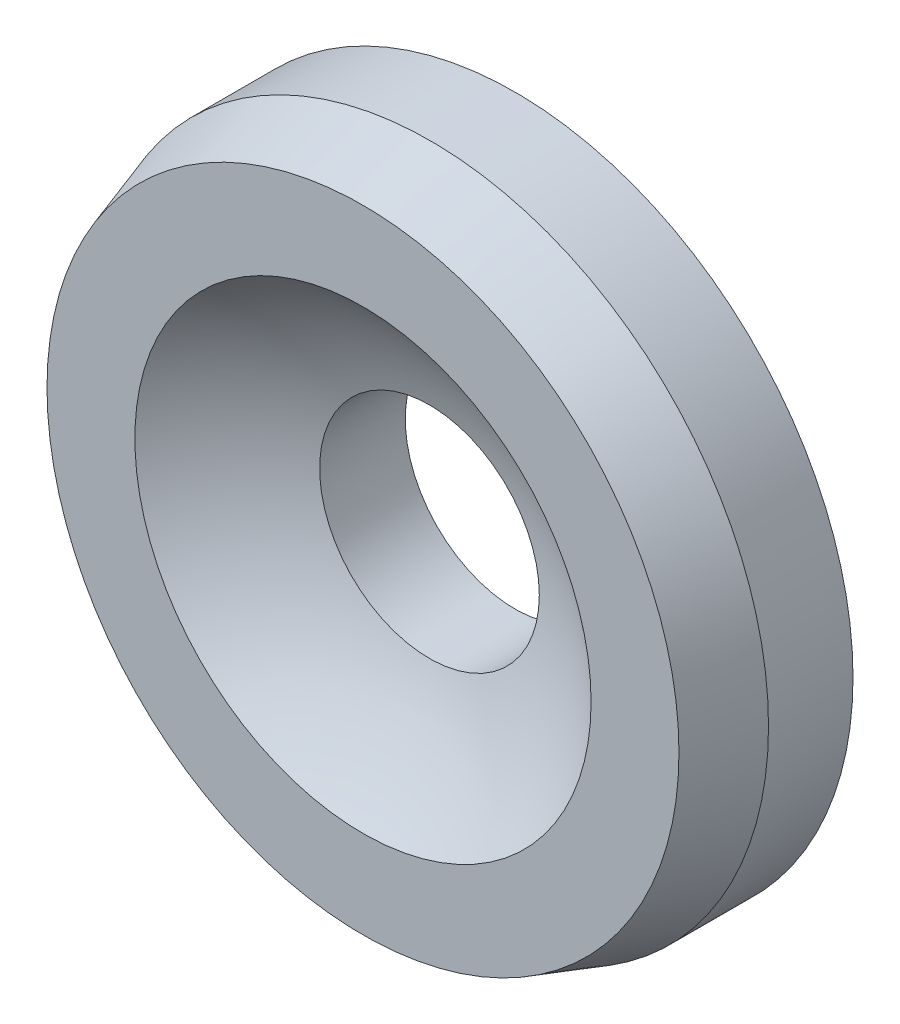
ISO-10303-21;
HEADER;
FILE_DESCRIPTION(('STEP AP214'),'2;1');
FILE_NAME('part.step','',(''),(''),'','','');
FILE_SCHEMA(('AUTOMOTIVE_DESIGN { 1 0 10303 214 1 1 1 1 }'));
ENDSEC;
DATA;
#1=APPLICATION_CONTEXT('core data for automotive mechanical design processes');
#2=APPLICATION_PROTOCOL_DEFINITION('international standard','automotive_design',2000,#1);
#3=PRODUCT_CONTEXT('',#1,'mechanical');
#4=PRODUCT('Part','Part','',(#3));
#5=PRODUCT_RELATED_PRODUCT_CATEGORY('part','',(#4));
#6=PRODUCT_DEFINITION_FORMATION('','',#4);
#7=PRODUCT_DEFINITION_CONTEXT('part definition',#1,'design');
#8=PRODUCT_DEFINITION('design','',#6,#7);
#9=PRODUCT_DEFINITION_SHAPE('','',#8);
#10=(LENGTH_UNIT() NAMED_UNIT(*) SI_UNIT(.MILLI.,.METRE.));
#11=(NAMED_UNIT(*) PLANE_ANGLE_UNIT() SI_UNIT($,.RADIAN.));
#12=(NAMED_UNIT(*) SI_UNIT($,.STERADIAN.) SOLID_ANGLE_UNIT());
#13=UNCERTAINTY_MEASURE_WITH_UNIT(LENGTH_MEASURE(1.E-05),#10,'distance_accuracy_value','');
#14=(GEOMETRIC_REPRESENTATION_CONTEXT(3) GLOBAL_UNCERTAINTY_ASSIGNED_CONTEXT((#13)) GLOBAL_UNIT_ASSIGNED_CONTEXT((#10,
#11,#12)) REPRESENTATION_CONTEXT('',''));
#15=CARTESIAN_POINT('',(0.,0.,0.));
#16=DIRECTION('',(0.,0.,1.));
#17=DIRECTION('',(1.,0.,0.));
#18=AXIS2_PLACEMENT_3D('',#15,#16,#17);
#19=CARTESIAN_POINT('',(-2.66226199830052,-6.07408479977046,1.77));
#20=DIRECTION('',(0.,0.,-1.));
#21=DIRECTION('',(-1.,0.,0.));
#22=AXIS2_PLACEMENT_3D('',#19,#20,#21);
#23=CONICAL_SURFACE('',#22,0.935016060753419,0.314159265358978);
#24=CARTESIAN_POINT('',(-2.66226199830052,-6.07408479977046,1.57));
#25=DIRECTION('',(0.,0.,1.));
#26=DIRECTION('',(1.,0.,0.));
#27=AXIS2_PLACEMENT_3D('',#24,#25,#26);
#28=CIRCLE('',#27,1.);
#29=CARTESIAN_POINT('',(-1.66226199830052,-6.07408479977046,1.57));
#30=VERTEX_POINT('',#29);
#31=EDGE_CURVE('E52',#30,#30,#28,.T.);
#32=ORIENTED_EDGE('',*,*,#31,.T.);
#33=EDGE_LOOP('',(#32));
#34=FACE_BOUND('',#33,.T.);
#35=CARTESIAN_POINT('',(-2.66226199830052,-6.07408479977046,1.77));
#36=DIRECTION('',(0.,0.,1.));
#37=DIRECTION('',(1.,0.,0.));
#38=AXIS2_PLACEMENT_3D('',#35,#36,#37);
#39=CIRCLE('',#38,0.935016060753419);
#40=CARTESIAN_POINT('',(-1.7272459375471,-6.07408479977046,1.77));
#41=VERTEX_POINT('',#40);
#42=EDGE_CURVE('E10',#41,#41,#39,.T.);
#43=ORIENTED_EDGE('',*,*,#42,.F.);
#44=EDGE_LOOP('',(#43));
#45=FACE_BOUND('',#44,.T.);
#46=ADVANCED_FACE('F30',(#34,#45),#23,.T.);
#47=CARTESIAN_POINT('',(-1.98726199830052,-6.07408479977046,1.77));
#48=DIRECTION('',(0.,0.,1.));
#49=DIRECTION('',(1.,0.,0.));
#50=AXIS2_PLACEMENT_3D('',#47,#48,#49);
#51=PLANE('',#50);
#52=ORIENTED_EDGE('',*,*,#42,.T.);
#53=EDGE_LOOP('',(#52));
#54=FACE_BOUND('',#53,.T.);
#55=CARTESIAN_POINT('',(-2.66226199830052,-6.07408479977046,1.77));
#56=DIRECTION('',(0.,0.,1.));
#57=DIRECTION('',(1.,0.,0.));
#58=AXIS2_PLACEMENT_3D('',#55,#56,#57);
#59=CIRCLE('',#58,0.675);
#60=CARTESIAN_POINT('',(-1.98726199830052,-6.07408479977046,1.77));
#61=VERTEX_POINT('',#60);
#62=EDGE_CURVE('E36',#61,#61,#59,.T.);
#63=ORIENTED_EDGE('',*,*,#62,.F.);
#64=EDGE_LOOP('',(#63));
#65=FACE_BOUND('',#64,.T.);
#66=ADVANCED_FACE('F70',(#54,#65),#51,.T.);
#67=CARTESIAN_POINT('',(-2.66226199830052,-6.07408479977046,2.56118581888201));
#68=DIRECTION('',(0.,0.,1.));
#69=DIRECTION('',(1.,0.,0.));
#70=AXIS2_PLACEMENT_3D('',#67,#68,#69);
#71=SPHERICAL_SURFACE('',#70,1.04);
#72=ORIENTED_EDGE('',*,*,#62,.T.);
#73=EDGE_LOOP('',(#72));
#74=FACE_BOUND('',#73,.T.);
#75=CARTESIAN_POINT('',(-2.66226199830052,-6.07408479977046,1.57327134889992));
#76=DIRECTION('',(0.,0.,1.));
#77=DIRECTION('',(1.,0.,0.));
#78=AXIS2_PLACEMENT_3D('',#75,#76,#77);
#79=CIRCLE('',#78,0.325);
#80=CARTESIAN_POINT('',(-2.33726199830052,-6.07408479977046,1.57327134889992));
#81=VERTEX_POINT('',#80);
#82=EDGE_CURVE('E40',#81,#81,#79,.T.);
#83=ORIENTED_EDGE('',*,*,#82,.F.);
#84=EDGE_LOOP('',(#83));
#85=FACE_BOUND('',#84,.T.);
#86=ADVANCED_FACE('F74',(#74,#85),#71,.F.);
#87=CARTESIAN_POINT('',(-2.66226199830052,-6.07408479977046,1.32));
#88=DIRECTION('',(0.,0.,1.));
#89=DIRECTION('',(1.,0.,0.));
#90=AXIS2_PLACEMENT_3D('',#87,#88,#89);
#91=CYLINDRICAL_SURFACE('',#90,0.325);
#92=ORIENTED_EDGE('',*,*,#82,.T.);
#93=EDGE_LOOP('',(#92));
#94=FACE_BOUND('',#93,.T.);
#95=CARTESIAN_POINT('',(-2.66226199830052,-6.07408479977046,1.32));
#96=DIRECTION('',(0.,0.,1.));
#97=DIRECTION('',(1.,0.,0.));
#98=AXIS2_PLACEMENT_3D('',#95,#96,#97);
#99=CIRCLE('',#98,0.325);
#100=CARTESIAN_POINT('',(-2.33726199830052,-6.07408479977046,1.32));
#101=VERTEX_POINT('',#100);
#102=EDGE_CURVE('E44',#101,#101,#99,.T.);
#103=ORIENTED_EDGE('',*,*,#102,.F.);
#104=EDGE_LOOP('',(#103));
#105=FACE_BOUND('',#104,.T.);
#106=ADVANCED_FACE('F66',(#94,#105),#91,.F.);
#107=CARTESIAN_POINT('',(-1.66226199830052,-6.07408479977046,1.32));
#108=DIRECTION('',(0.,0.,-1.));
#109=DIRECTION('',(-1.,0.,0.));
#110=AXIS2_PLACEMENT_3D('',#107,#108,#109);
#111=PLANE('',#110);
#112=ORIENTED_EDGE('',*,*,#102,.T.);
#113=EDGE_LOOP('',(#112));
#114=FACE_BOUND('',#113,.T.);
#115=CARTESIAN_POINT('',(-2.66226199830052,-6.07408479977046,1.32));
#116=DIRECTION('',(0.,0.,1.));
#117=DIRECTION('',(1.,0.,0.));
#118=AXIS2_PLACEMENT_3D('',#115,#116,#117);
#119=CIRCLE('',#118,1.);
#120=CARTESIAN_POINT('',(-1.66226199830052,-6.07408479977046,1.32));
#121=VERTEX_POINT('',#120);
#122=EDGE_CURVE('E49',#121,#121,#119,.T.);
#123=ORIENTED_EDGE('',*,*,#122,.F.);
#124=EDGE_LOOP('',(#123));
#125=FACE_BOUND('',#124,.T.);
#126=ADVANCED_FACE('F60',(#114,#125),#111,.T.);
#127=CARTESIAN_POINT('',(-2.66226199830052,-6.07408479977046,1.32));
#128=DIRECTION('',(0.,0.,1.));
#129=DIRECTION('',(1.,0.,0.));
#130=AXIS2_PLACEMENT_3D('',#127,#128,#129);
#131=CYLINDRICAL_SURFACE('',#130,1.);
#132=ORIENTED_EDGE('',*,*,#122,.T.);
#133=EDGE_LOOP('',(#132));
#134=FACE_BOUND('',#133,.T.);
#135=ORIENTED_EDGE('',*,*,#31,.F.);
#136=EDGE_LOOP('',(#135));
#137=FACE_BOUND('',#136,.T.);
#138=ADVANCED_FACE('F58',(#134,#137),#131,.T.);
#139=CLOSED_SHELL('',(#46,#66,#86,#106,#126,#138));
#140=MANIFOLD_SOLID_BREP('B2',#139);
#141=ADVANCED_BREP_SHAPE_REPRESENTATION('',(#18,#140),#14);
#142=SHAPE_DEFINITION_REPRESENTATION(#9,#141);
ENDSEC;
END-ISO-10303-21;
